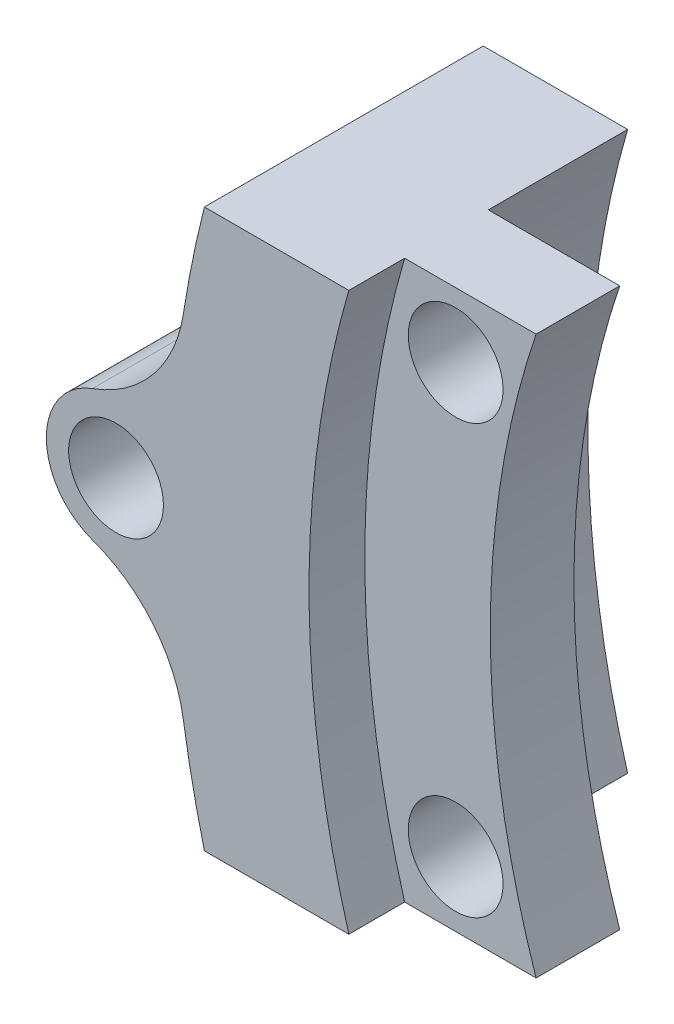
ISO-10303-21;
HEADER;
FILE_DESCRIPTION(('STEP AP214'),'2;1');
FILE_NAME('part.step','',(''),(''),'','','');
FILE_SCHEMA(('AUTOMOTIVE_DESIGN { 1 0 10303 214 1 1 1 1 }'));
ENDSEC;
DATA;
#1=APPLICATION_CONTEXT('core data for automotive mechanical design processes');
#2=APPLICATION_PROTOCOL_DEFINITION('international standard','automotive_design',2000,#1);
#3=PRODUCT_CONTEXT('',#1,'mechanical');
#4=PRODUCT('Part','Part','',(#3));
#5=PRODUCT_RELATED_PRODUCT_CATEGORY('part','',(#4));
#6=PRODUCT_DEFINITION_FORMATION('','',#4);
#7=PRODUCT_DEFINITION_CONTEXT('part definition',#1,'design');
#8=PRODUCT_DEFINITION('design','',#6,#7);
#9=PRODUCT_DEFINITION_SHAPE('','',#8);
#10=(LENGTH_UNIT() NAMED_UNIT(*) SI_UNIT(.MILLI.,.METRE.));
#11=(NAMED_UNIT(*) PLANE_ANGLE_UNIT() SI_UNIT($,.RADIAN.));
#12=(NAMED_UNIT(*) SI_UNIT($,.STERADIAN.) SOLID_ANGLE_UNIT());
#13=UNCERTAINTY_MEASURE_WITH_UNIT(LENGTH_MEASURE(1.E-05),#10,'distance_accuracy_value','');
#14=(GEOMETRIC_REPRESENTATION_CONTEXT(3) GLOBAL_UNCERTAINTY_ASSIGNED_CONTEXT((#13)) GLOBAL_UNIT_ASSIGNED_CONTEXT((#10,
#11,#12)) REPRESENTATION_CONTEXT('',''));
#15=CARTESIAN_POINT('',(0.,0.,0.));
#16=DIRECTION('',(0.,0.,1.));
#17=DIRECTION('',(1.,0.,0.));
#18=AXIS2_PLACEMENT_3D('',#15,#16,#17);
#19=CARTESIAN_POINT('',(0.,0.,0.));
#20=DIRECTION('',(0.,0.,1.));
#21=DIRECTION('',(1.,0.,0.));
#22=AXIS2_PLACEMENT_3D('',#19,#20,#21);
#23=PLANE('',#22);
#24=CARTESIAN_POINT('',(-42.6732405888687,0.,0.));
#25=DIRECTION('',(0.,0.,-1.));
#26=DIRECTION('',(-1.,0.,0.));
#27=AXIS2_PLACEMENT_3D('',#24,#25,#26);
#28=CIRCLE('',#27,2.64999999999999);
#29=CARTESIAN_POINT('',(-40.7110570278767,1.78110518301772,0.));
#30=VERTEX_POINT('',#29);
#31=CARTESIAN_POINT('',(-40.7110570278767,-1.78110518301772,0.));
#32=VERTEX_POINT('',#31);
#33=EDGE_CURVE('E135',#30,#32,#28,.T.);
#34=ORIENTED_EDGE('',*,*,#33,.F.);
#35=CARTESIAN_POINT('',(0.,0.,0.));
#36=DIRECTION('',(0.,0.,1.));
#37=DIRECTION('',(1.,0.,0.));
#38=AXIS2_PLACEMENT_3D('',#35,#36,#37);
#39=CIRCLE('',#38,40.75);
#40=CARTESIAN_POINT('',(-39.5039554981523,10.,0.));
#41=VERTEX_POINT('',#40);
#42=EDGE_CURVE('E146',#41,#30,#39,.T.);
#43=ORIENTED_EDGE('',*,*,#42,.F.);
#44=DIRECTION('',(-1.,0.,0.));
#45=VECTOR('',#44,1.);
#46=CARTESIAN_POINT('',(-39.5039554981523,10.,0.));
#47=LINE('',#46,#45);
#48=CARTESIAN_POINT('',(-34.3229150859888,10.,0.));
#49=VERTEX_POINT('',#48);
#50=EDGE_CURVE('E247',#49,#41,#47,.T.);
#51=ORIENTED_EDGE('',*,*,#50,.F.);
#52=CARTESIAN_POINT('',(0.,0.,0.));
#53=DIRECTION('',(0.,0.,1.));
#54=DIRECTION('',(1.,0.,0.));
#55=AXIS2_PLACEMENT_3D('',#52,#53,#54);
#56=CIRCLE('',#55,35.75);
#57=CARTESIAN_POINT('',(-34.3229150859888,-10.,0.));
#58=VERTEX_POINT('',#57);
#59=EDGE_CURVE('E203',#49,#58,#56,.T.);
#60=ORIENTED_EDGE('',*,*,#59,.T.);
#61=DIRECTION('',(1.,0.,0.));
#62=VECTOR('',#61,1.);
#63=CARTESIAN_POINT('',(-34.3229150859888,-10.,0.));
#64=LINE('',#63,#62);
#65=CARTESIAN_POINT('',(-39.5039554981523,-10.,0.));
#66=VERTEX_POINT('',#65);
#67=EDGE_CURVE('E255',#66,#58,#64,.T.);
#68=ORIENTED_EDGE('',*,*,#67,.F.);
#69=EDGE_CURVE('E208',#32,#66,#39,.T.);
#70=ORIENTED_EDGE('',*,*,#69,.F.);
#71=EDGE_LOOP('',(#34,#43,#51,#60,#68,#70));
#72=FACE_BOUND('',#71,.T.);
#73=ADVANCED_FACE('F32',(#72),#23,.F.);
#74=CARTESIAN_POINT('',(0.,0.,10.));
#75=DIRECTION('',(0.,0.,-1.));
#76=DIRECTION('',(-1.,0.,0.));
#77=AXIS2_PLACEMENT_3D('',#74,#75,#76);
#78=CYLINDRICAL_SURFACE('',#77,40.75);
#79=ORIENTED_EDGE('',*,*,#42,.T.);
#80=DIRECTION('',(0.,0.,-1.));
#81=VECTOR('',#80,1.);
#82=CARTESIAN_POINT('',(-40.7110570278767,1.78110518301773,2.5));
#83=LINE('',#82,#81);
#84=CARTESIAN_POINT('',(-40.7110570278767,1.78110518301774,5.));
#85=VERTEX_POINT('',#84);
#86=EDGE_CURVE('E131',#30,#85,#83,.F.);
#87=ORIENTED_EDGE('',*,*,#86,.T.);
#88=CARTESIAN_POINT('',(0.,0.,5.));
#89=DIRECTION('',(0.,0.,-1.));
#90=DIRECTION('',(1.,0.,0.));
#91=AXIS2_PLACEMENT_3D('',#88,#89,#90);
#92=CIRCLE('',#91,40.75);
#93=CARTESIAN_POINT('',(-40.2617479420352,6.28920922310784,5.));
#94=VERTEX_POINT('',#93);
#95=EDGE_CURVE('E142',#85,#94,#92,.T.);
#96=ORIENTED_EDGE('',*,*,#95,.T.);
#97=DIRECTION('',(0.,0.,-1.));
#98=VECTOR('',#97,1.);
#99=CARTESIAN_POINT('',(-40.2617479420352,6.28920922310784,10.));
#100=LINE('',#99,#98);
#101=CARTESIAN_POINT('',(-40.2617479420352,6.28920922310784,10.));
#102=VERTEX_POINT('',#101);
#103=EDGE_CURVE('E220',#94,#102,#100,.F.);
#104=ORIENTED_EDGE('',*,*,#103,.T.);
#105=CARTESIAN_POINT('',(0.,0.,10.));
#106=DIRECTION('',(0.,0.,1.));
#107=DIRECTION('',(1.,0.,0.));
#108=AXIS2_PLACEMENT_3D('',#105,#106,#107);
#109=CIRCLE('',#108,40.75);
#110=CARTESIAN_POINT('',(-39.5039554981523,10.,10.));
#111=VERTEX_POINT('',#110);
#112=EDGE_CURVE('E214',#111,#102,#109,.T.);
#113=ORIENTED_EDGE('',*,*,#112,.F.);
#114=DIRECTION('',(0.,0.,-1.));
#115=VECTOR('',#114,1.);
#116=CARTESIAN_POINT('',(-39.5039554981523,10.,10.));
#117=LINE('',#116,#115);
#118=EDGE_CURVE('E240',#111,#41,#117,.T.);
#119=ORIENTED_EDGE('',*,*,#118,.T.);
#120=EDGE_LOOP('',(#79,#87,#96,#104,#113,#119));
#121=FACE_BOUND('',#120,.T.);
#122=ADVANCED_FACE('F140',(#121),#78,.T.);
#123=CARTESIAN_POINT('',(0.,0.,10.));
#124=DIRECTION('',(0.,0.,-1.));
#125=DIRECTION('',(-1.,0.,0.));
#126=AXIS2_PLACEMENT_3D('',#123,#124,#125);
#127=CYLINDRICAL_SURFACE('',#126,35.75);
#128=DIRECTION('',(0.,0.,1.));
#129=VECTOR('',#128,1.);
#130=CARTESIAN_POINT('',(-34.3229150859888,-10.,-142.119605378212));
#131=LINE('',#130,#129);
#132=CARTESIAN_POINT('',(-34.3229150859888,-10.,5.));
#133=VERTEX_POINT('',#132);
#134=EDGE_CURVE('E256',#58,#133,#131,.T.);
#135=ORIENTED_EDGE('',*,*,#134,.F.);
#136=ORIENTED_EDGE('',*,*,#59,.F.);
#137=DIRECTION('',(0.,0.,-1.));
#138=VECTOR('',#137,1.);
#139=CARTESIAN_POINT('',(-34.3229150859888,10.,10.));
#140=LINE('',#139,#138);
#141=CARTESIAN_POINT('',(-34.3229150859888,10.,5.));
#142=VERTEX_POINT('',#141);
#143=EDGE_CURVE('E243',#142,#49,#140,.T.);
#144=ORIENTED_EDGE('',*,*,#143,.F.);
#145=CARTESIAN_POINT('',(0.,0.,5.));
#146=DIRECTION('',(0.,0.,-1.));
#147=DIRECTION('',(-1.,0.,0.));
#148=AXIS2_PLACEMENT_3D('',#145,#146,#147);
#149=CIRCLE('',#148,35.75);
#150=EDGE_CURVE('E174',#133,#142,#149,.T.);
#151=ORIENTED_EDGE('',*,*,#150,.F.);
#152=EDGE_LOOP('',(#135,#136,#144,#151));
#153=FACE_BOUND('',#152,.T.);
#154=ADVANCED_FACE('F285',(#153),#127,.F.);
#155=CARTESIAN_POINT('',(-34.3229150859888,-10.,8.00000000000001));
#156=VERTEX_POINT('',#155);
#157=CARTESIAN_POINT('',(-34.3229150859888,-10.,10.));
#158=VERTEX_POINT('',#157);
#159=EDGE_CURVE('E262',#156,#158,#131,.T.);
#160=ORIENTED_EDGE('',*,*,#159,.F.);
#161=CARTESIAN_POINT('',(0.,0.,8.));
#162=DIRECTION('',(0.,0.,-1.));
#163=DIRECTION('',(-1.,0.,0.));
#164=AXIS2_PLACEMENT_3D('',#161,#162,#163);
#165=CIRCLE('',#164,35.75);
#166=CARTESIAN_POINT('',(-34.3229150859888,10.,8.));
#167=VERTEX_POINT('',#166);
#168=EDGE_CURVE('E177',#156,#167,#165,.T.);
#169=ORIENTED_EDGE('',*,*,#168,.T.);
#170=CARTESIAN_POINT('',(-34.3229150859888,10.,10.));
#171=VERTEX_POINT('',#170);
#172=EDGE_CURVE('E242',#171,#167,#140,.T.);
#173=ORIENTED_EDGE('',*,*,#172,.F.);
#174=CARTESIAN_POINT('',(0.,0.,10.));
#175=DIRECTION('',(0.,0.,1.));
#176=DIRECTION('',(1.,0.,0.));
#177=AXIS2_PLACEMENT_3D('',#174,#175,#176);
#178=CIRCLE('',#177,35.75);
#179=EDGE_CURVE('E205',#171,#158,#178,.T.);
#180=ORIENTED_EDGE('',*,*,#179,.T.);
#181=EDGE_LOOP('',(#160,#169,#173,#180));
#182=FACE_BOUND('',#181,.T.);
#183=ADVANCED_FACE('F276',(#182),#127,.F.);
#184=CARTESIAN_POINT('',(0.,0.,10.));
#185=DIRECTION('',(0.,0.,1.));
#186=DIRECTION('',(1.,0.,0.));
#187=AXIS2_PLACEMENT_3D('',#184,#185,#186);
#188=PLANE('',#187);
#189=DIRECTION('',(-1.,0.,0.));
#190=VECTOR('',#189,1.);
#191=CARTESIAN_POINT('',(-34.3229150859888,-10.,10.));
#192=LINE('',#191,#190);
#193=CARTESIAN_POINT('',(-39.5039554981523,-10.,10.));
#194=VERTEX_POINT('',#193);
#195=EDGE_CURVE('E259',#158,#194,#192,.T.);
#196=ORIENTED_EDGE('',*,*,#195,.F.);
#197=ORIENTED_EDGE('',*,*,#179,.F.);
#198=DIRECTION('',(1.,0.,0.));
#199=VECTOR('',#198,1.);
#200=CARTESIAN_POINT('',(-39.5039554981523,10.,10.));
#201=LINE('',#200,#199);
#202=EDGE_CURVE('E147',#111,#171,#201,.T.);
#203=ORIENTED_EDGE('',*,*,#202,.F.);
#204=ORIENTED_EDGE('',*,*,#112,.T.);
#205=CARTESIAN_POINT('',(-45.201839714064,7.0608913363726,10.));
#206=DIRECTION('',(0.,0.,1.));
#207=DIRECTION('',(1.,0.,0.));
#208=AXIS2_PLACEMENT_3D('',#205,#206,#207);
#209=CIRCLE('',#208,5.);
#210=CARTESIAN_POINT('',(-43.5161069639338,2.35363044545753,10.));
#211=VERTEX_POINT('',#210);
#212=EDGE_CURVE('E40',#102,#211,#209,.F.);
#213=ORIENTED_EDGE('',*,*,#212,.T.);
#214=CARTESIAN_POINT('',(-42.6732405888687,0.,10.));
#215=DIRECTION('',(0.,0.,1.));
#216=DIRECTION('',(1.,0.,0.));
#217=AXIS2_PLACEMENT_3D('',#214,#215,#216);
#218=CIRCLE('',#217,2.5);
#219=CARTESIAN_POINT('',(-43.5161069639338,-2.35363044545753,10.));
#220=VERTEX_POINT('',#219);
#221=EDGE_CURVE('E152',#211,#220,#218,.T.);
#222=ORIENTED_EDGE('',*,*,#221,.T.);
#223=CARTESIAN_POINT('',(-45.201839714064,-7.06089133637259,10.));
#224=DIRECTION('',(0.,0.,1.));
#225=DIRECTION('',(1.,0.,0.));
#226=AXIS2_PLACEMENT_3D('',#223,#224,#225);
#227=CIRCLE('',#226,5.);
#228=CARTESIAN_POINT('',(-40.2617479420352,-6.28920922310783,10.));
#229=VERTEX_POINT('',#228);
#230=EDGE_CURVE('E224',#220,#229,#227,.F.);
#231=ORIENTED_EDGE('',*,*,#230,.T.);
#232=EDGE_CURVE('E211',#229,#194,#109,.T.);
#233=ORIENTED_EDGE('',*,*,#232,.T.);
#234=EDGE_LOOP('',(#196,#197,#203,#204,#213,#222,#231,#233));
#235=FACE_BOUND('',#234,.T.);
#236=CARTESIAN_POINT('',(-42.6732405888687,0.,10.));
#237=DIRECTION('',(0.,0.,1.));
#238=DIRECTION('',(1.,0.,0.));
#239=AXIS2_PLACEMENT_3D('',#236,#237,#238);
#240=CIRCLE('',#239,1.7);
#241=CARTESIAN_POINT('',(-40.9732405888687,0.,10.));
#242=VERTEX_POINT('',#241);
#243=EDGE_CURVE('E160',#242,#242,#240,.T.);
#244=ORIENTED_EDGE('',*,*,#243,.F.);
#245=EDGE_LOOP('',(#244));
#246=FACE_BOUND('',#245,.T.);
#247=ADVANCED_FACE('F231',(#235,#246),#188,.T.);
#248=CARTESIAN_POINT('',(-40.2617479420352,-6.28920922310783,5.));
#249=VERTEX_POINT('',#248);
#250=CARTESIAN_POINT('',(-40.7110570278767,-1.78110518301777,5.));
#251=VERTEX_POINT('',#250);
#252=EDGE_CURVE('E52',#249,#251,#92,.T.);
#253=ORIENTED_EDGE('',*,*,#252,.T.);
#254=DIRECTION('',(0.,0.,-1.));
#255=VECTOR('',#254,1.);
#256=CARTESIAN_POINT('',(-40.7110570278767,-1.78110518301773,2.5));
#257=LINE('',#256,#255);
#258=EDGE_CURVE('E134',#251,#32,#257,.T.);
#259=ORIENTED_EDGE('',*,*,#258,.T.);
#260=ORIENTED_EDGE('',*,*,#69,.T.);
#261=DIRECTION('',(0.,0.,-1.));
#262=VECTOR('',#261,1.);
#263=CARTESIAN_POINT('',(-39.5039554981523,-10.,10.));
#264=LINE('',#263,#262);
#265=EDGE_CURVE('E265',#66,#194,#264,.F.);
#266=ORIENTED_EDGE('',*,*,#265,.T.);
#267=ORIENTED_EDGE('',*,*,#232,.F.);
#268=DIRECTION('',(0.,0.,-1.));
#269=VECTOR('',#268,1.);
#270=CARTESIAN_POINT('',(-40.2617479420352,-6.28920922310783,10.));
#271=LINE('',#270,#269);
#272=EDGE_CURVE('E222',#229,#249,#271,.T.);
#273=ORIENTED_EDGE('',*,*,#272,.T.);
#274=EDGE_LOOP('',(#253,#259,#260,#266,#267,#273));
#275=FACE_BOUND('',#274,.T.);
#276=ADVANCED_FACE('F275',(#275),#78,.T.);
#277=CARTESIAN_POINT('',(-34.3229150859888,-10.,8.));
#278=DIRECTION('',(0.,-1.,0.));
#279=DIRECTION('',(1.,0.,0.));
#280=AXIS2_PLACEMENT_3D('',#277,#278,#279);
#281=PLANE('',#280);
#282=DIRECTION('',(-1.,0.,0.));
#283=VECTOR('',#282,1.);
#284=CARTESIAN_POINT('',(-34.3229150859888,-10.,5.));
#285=LINE('',#284,#283);
#286=CARTESIAN_POINT('',(-29.6067982058175,-10.,5.));
#287=VERTEX_POINT('',#286);
#288=EDGE_CURVE('E181',#287,#133,#285,.T.);
#289=ORIENTED_EDGE('',*,*,#288,.F.);
#290=DIRECTION('',(0.,0.,-1.));
#291=VECTOR('',#290,1.);
#292=CARTESIAN_POINT('',(-29.6067982058175,-10.,8.));
#293=LINE('',#292,#291);
#294=CARTESIAN_POINT('',(-29.6067982058175,-10.,8.));
#295=VERTEX_POINT('',#294);
#296=EDGE_CURVE('E201',#295,#287,#293,.T.);
#297=ORIENTED_EDGE('',*,*,#296,.F.);
#298=DIRECTION('',(-1.,0.,0.));
#299=VECTOR('',#298,1.);
#300=CARTESIAN_POINT('',(-34.3229150859888,-10.,8.));
#301=LINE('',#300,#299);
#302=EDGE_CURVE('E187',#295,#156,#301,.T.);
#303=ORIENTED_EDGE('',*,*,#302,.T.);
#304=ORIENTED_EDGE('',*,*,#159,.T.);
#305=ORIENTED_EDGE('',*,*,#195,.T.);
#306=ORIENTED_EDGE('',*,*,#265,.F.);
#307=ORIENTED_EDGE('',*,*,#67,.T.);
#308=ORIENTED_EDGE('',*,*,#134,.T.);
#309=EDGE_LOOP('',(#289,#297,#303,#304,#305,#306,#307,#308));
#310=FACE_BOUND('',#309,.T.);
#311=ADVANCED_FACE('F282',(#310),#281,.T.);
#312=CARTESIAN_POINT('',(0.,0.,8.));
#313=DIRECTION('',(0.,0.,-1.));
#314=DIRECTION('',(-1.,0.,0.));
#315=AXIS2_PLACEMENT_3D('',#312,#313,#314);
#316=CYLINDRICAL_SURFACE('',#315,31.25);
#317=CARTESIAN_POINT('',(0.,0.,5.));
#318=DIRECTION('',(0.,0.,1.));
#319=DIRECTION('',(-1.,0.,0.));
#320=AXIS2_PLACEMENT_3D('',#317,#318,#319);
#321=CIRCLE('',#320,31.25);
#322=CARTESIAN_POINT('',(-29.6067982058175,10.,5.));
#323=VERTEX_POINT('',#322);
#324=EDGE_CURVE('E196',#323,#287,#321,.T.);
#325=ORIENTED_EDGE('',*,*,#324,.F.);
#326=DIRECTION('',(0.,0.,-1.));
#327=VECTOR('',#326,1.);
#328=CARTESIAN_POINT('',(-29.6067982058175,10.,8.));
#329=LINE('',#328,#327);
#330=CARTESIAN_POINT('',(-29.6067982058175,10.,8.));
#331=VERTEX_POINT('',#330);
#332=EDGE_CURVE('E190',#331,#323,#329,.T.);
#333=ORIENTED_EDGE('',*,*,#332,.F.);
#334=CARTESIAN_POINT('',(0.,0.,8.));
#335=DIRECTION('',(0.,0.,1.));
#336=DIRECTION('',(-1.,0.,0.));
#337=AXIS2_PLACEMENT_3D('',#334,#335,#336);
#338=CIRCLE('',#337,31.25);
#339=EDGE_CURVE('E184',#331,#295,#338,.T.);
#340=ORIENTED_EDGE('',*,*,#339,.T.);
#341=ORIENTED_EDGE('',*,*,#296,.T.);
#342=EDGE_LOOP('',(#325,#333,#340,#341));
#343=FACE_BOUND('',#342,.T.);
#344=ADVANCED_FACE('F316',(#343),#316,.F.);
#345=CARTESIAN_POINT('',(-34.3229150859888,10.,8.));
#346=DIRECTION('',(0.,1.,0.));
#347=DIRECTION('',(-1.,0.,0.));
#348=AXIS2_PLACEMENT_3D('',#345,#346,#347);
#349=PLANE('',#348);
#350=DIRECTION('',(1.,0.,0.));
#351=VECTOR('',#350,1.);
#352=CARTESIAN_POINT('',(-34.3229150859888,10.,5.));
#353=LINE('',#352,#351);
#354=EDGE_CURVE('E193',#142,#323,#353,.T.);
#355=ORIENTED_EDGE('',*,*,#354,.F.);
#356=ORIENTED_EDGE('',*,*,#143,.T.);
#357=ORIENTED_EDGE('',*,*,#50,.T.);
#358=ORIENTED_EDGE('',*,*,#118,.F.);
#359=ORIENTED_EDGE('',*,*,#202,.T.);
#360=ORIENTED_EDGE('',*,*,#172,.T.);
#361=DIRECTION('',(1.,0.,0.));
#362=VECTOR('',#361,1.);
#363=CARTESIAN_POINT('',(-34.3229150859888,10.,8.));
#364=LINE('',#363,#362);
#365=EDGE_CURVE('E180',#167,#331,#364,.T.);
#366=ORIENTED_EDGE('',*,*,#365,.T.);
#367=ORIENTED_EDGE('',*,*,#332,.T.);
#368=EDGE_LOOP('',(#355,#356,#357,#358,#359,#360,#366,#367));
#369=FACE_BOUND('',#368,.T.);
#370=ADVANCED_FACE('F325',(#369),#349,.T.);
#371=CARTESIAN_POINT('',(0.,0.,8.));
#372=DIRECTION('',(0.,0.,-1.));
#373=DIRECTION('',(-1.,0.,0.));
#374=AXIS2_PLACEMENT_3D('',#371,#372,#373);
#375=PLANE('',#374);
#376=CARTESIAN_POINT('',(-32.4924184258218,-7.67716535443942,8.));
#377=DIRECTION('',(0.,0.,-1.));
#378=DIRECTION('',(1.,0.,0.));
#379=AXIS2_PLACEMENT_3D('',#376,#377,#378);
#380=CIRCLE('',#379,1.7);
#381=CARTESIAN_POINT('',(-30.7924184258218,-7.67716535443942,8.));
#382=VERTEX_POINT('',#381);
#383=EDGE_CURVE('E165',#382,#382,#380,.T.);
#384=ORIENTED_EDGE('',*,*,#383,.T.);
#385=EDGE_LOOP('',(#384));
#386=FACE_BOUND('',#385,.T.);
#387=CARTESIAN_POINT('',(-32.4924184258218,7.67716535443942,8.));
#388=DIRECTION('',(0.,0.,-1.));
#389=DIRECTION('',(-1.,0.,0.));
#390=AXIS2_PLACEMENT_3D('',#387,#388,#389);
#391=CIRCLE('',#390,1.7);
#392=CARTESIAN_POINT('',(-34.1924184258218,7.67716535443942,8.));
#393=VERTEX_POINT('',#392);
#394=EDGE_CURVE('E171',#393,#393,#391,.T.);
#395=ORIENTED_EDGE('',*,*,#394,.T.);
#396=EDGE_LOOP('',(#395));
#397=FACE_BOUND('',#396,.T.);
#398=ORIENTED_EDGE('',*,*,#168,.F.);
#399=ORIENTED_EDGE('',*,*,#302,.F.);
#400=ORIENTED_EDGE('',*,*,#339,.F.);
#401=ORIENTED_EDGE('',*,*,#365,.F.);
#402=EDGE_LOOP('',(#398,#399,#400,#401));
#403=FACE_BOUND('',#402,.T.);
#404=ADVANCED_FACE('F322',(#386,#397,#403),#375,.F.);
#405=CARTESIAN_POINT('',(0.,0.,5.));
#406=DIRECTION('',(0.,0.,-1.));
#407=DIRECTION('',(-1.,0.,0.));
#408=AXIS2_PLACEMENT_3D('',#405,#406,#407);
#409=PLANE('',#408);
#410=CARTESIAN_POINT('',(-32.4924184258218,-7.67716535443942,5.));
#411=DIRECTION('',(0.,0.,-1.));
#412=DIRECTION('',(1.,0.,0.));
#413=AXIS2_PLACEMENT_3D('',#410,#411,#412);
#414=CIRCLE('',#413,1.7);
#415=CARTESIAN_POINT('',(-30.7924184258218,-7.67716535443942,5.));
#416=VERTEX_POINT('',#415);
#417=EDGE_CURVE('E163',#416,#416,#414,.T.);
#418=ORIENTED_EDGE('',*,*,#417,.F.);
#419=EDGE_LOOP('',(#418));
#420=FACE_BOUND('',#419,.T.);
#421=CARTESIAN_POINT('',(-32.4924184258218,7.67716535443942,5.));
#422=DIRECTION('',(0.,0.,-1.));
#423=DIRECTION('',(-1.,0.,0.));
#424=AXIS2_PLACEMENT_3D('',#421,#422,#423);
#425=CIRCLE('',#424,1.7);
#426=CARTESIAN_POINT('',(-34.1924184258218,7.67716535443942,5.));
#427=VERTEX_POINT('',#426);
#428=EDGE_CURVE('E168',#427,#427,#425,.T.);
#429=ORIENTED_EDGE('',*,*,#428,.F.);
#430=EDGE_LOOP('',(#429));
#431=FACE_BOUND('',#430,.T.);
#432=ORIENTED_EDGE('',*,*,#150,.T.);
#433=ORIENTED_EDGE('',*,*,#354,.T.);
#434=ORIENTED_EDGE('',*,*,#324,.T.);
#435=ORIENTED_EDGE('',*,*,#288,.T.);
#436=EDGE_LOOP('',(#432,#433,#434,#435));
#437=FACE_BOUND('',#436,.T.);
#438=ADVANCED_FACE('F313',(#420,#431,#437),#409,.T.);
#439=CARTESIAN_POINT('',(-32.4924184258218,7.67716535443942,8.));
#440=DIRECTION('',(0.,0.,-1.));
#441=DIRECTION('',(-1.,0.,0.));
#442=AXIS2_PLACEMENT_3D('',#439,#440,#441);
#443=CYLINDRICAL_SURFACE('',#442,1.7);
#444=ORIENTED_EDGE('',*,*,#394,.F.);
#445=EDGE_LOOP('',(#444));
#446=FACE_BOUND('',#445,.T.);
#447=ORIENTED_EDGE('',*,*,#428,.T.);
#448=EDGE_LOOP('',(#447));
#449=FACE_BOUND('',#448,.T.);
#450=ADVANCED_FACE('F339',(#446,#449),#443,.F.);
#451=CARTESIAN_POINT('',(-32.4924184258218,-7.67716535443942,8.));
#452=DIRECTION('',(0.,0.,-1.));
#453=DIRECTION('',(-1.,0.,0.));
#454=AXIS2_PLACEMENT_3D('',#451,#452,#453);
#455=CYLINDRICAL_SURFACE('',#454,1.7);
#456=ORIENTED_EDGE('',*,*,#383,.F.);
#457=EDGE_LOOP('',(#456));
#458=FACE_BOUND('',#457,.T.);
#459=ORIENTED_EDGE('',*,*,#417,.T.);
#460=EDGE_LOOP('',(#459));
#461=FACE_BOUND('',#460,.T.);
#462=ADVANCED_FACE('F344',(#458,#461),#455,.F.);
#463=CARTESIAN_POINT('',(-42.6732405888687,0.,5.));
#464=DIRECTION('',(0.,0.,1.));
#465=DIRECTION('',(1.,0.,0.));
#466=AXIS2_PLACEMENT_3D('',#463,#464,#465);
#467=CYLINDRICAL_SURFACE('',#466,2.5);
#468=CARTESIAN_POINT('',(-42.6732405888687,0.,5.));
#469=DIRECTION('',(0.,0.,1.));
#470=DIRECTION('',(1.,0.,0.));
#471=AXIS2_PLACEMENT_3D('',#468,#469,#470);
#472=CIRCLE('',#471,2.5);
#473=CARTESIAN_POINT('',(-43.5161069639338,2.35363044545753,5.));
#474=VERTEX_POINT('',#473);
#475=CARTESIAN_POINT('',(-43.5161069639338,-2.35363044545753,5.));
#476=VERTEX_POINT('',#475);
#477=EDGE_CURVE('E154',#474,#476,#472,.T.);
#478=ORIENTED_EDGE('',*,*,#477,.T.);
#479=DIRECTION('',(0.,0.,1.));
#480=VECTOR('',#479,1.);
#481=CARTESIAN_POINT('',(-43.5161069639338,-2.35363044545753,5.));
#482=LINE('',#481,#480);
#483=EDGE_CURVE('E217',#476,#220,#482,.T.);
#484=ORIENTED_EDGE('',*,*,#483,.T.);
#485=ORIENTED_EDGE('',*,*,#221,.F.);
#486=DIRECTION('',(0.,0.,1.));
#487=VECTOR('',#486,1.);
#488=CARTESIAN_POINT('',(-43.5161069639338,2.35363044545753,5.));
#489=LINE('',#488,#487);
#490=EDGE_CURVE('E213',#211,#474,#489,.F.);
#491=ORIENTED_EDGE('',*,*,#490,.T.);
#492=EDGE_LOOP('',(#478,#484,#485,#491));
#493=FACE_BOUND('',#492,.T.);
#494=ADVANCED_FACE('F238',(#493),#467,.T.);
#495=CARTESIAN_POINT('',(0.,0.,5.));
#496=DIRECTION('',(0.,0.,1.));
#497=DIRECTION('',(1.,0.,0.));
#498=AXIS2_PLACEMENT_3D('',#495,#496,#497);
#499=PLANE('',#498);
#500=CARTESIAN_POINT('',(-42.6732405888687,0.,5.));
#501=DIRECTION('',(0.,0.,1.));
#502=DIRECTION('',(1.,0.,0.));
#503=AXIS2_PLACEMENT_3D('',#500,#501,#502);
#504=CIRCLE('',#503,1.7);
#505=CARTESIAN_POINT('',(-40.9732405888687,0.,5.));
#506=VERTEX_POINT('',#505);
#507=EDGE_CURVE('E156',#506,#506,#504,.T.);
#508=ORIENTED_EDGE('',*,*,#507,.T.);
#509=EDGE_LOOP('',(#508));
#510=FACE_BOUND('',#509,.T.);
#511=CARTESIAN_POINT('',(-45.201839714064,7.0608913363726,5.));
#512=DIRECTION('',(0.,0.,1.));
#513=DIRECTION('',(1.,0.,0.));
#514=AXIS2_PLACEMENT_3D('',#511,#512,#513);
#515=CIRCLE('',#514,5.);
#516=EDGE_CURVE('E11',#474,#94,#515,.T.);
#517=ORIENTED_EDGE('',*,*,#516,.T.);
#518=ORIENTED_EDGE('',*,*,#95,.F.);
#519=CARTESIAN_POINT('',(-42.6732405888687,0.,5.));
#520=DIRECTION('',(0.,0.,-1.));
#521=DIRECTION('',(-1.,0.,0.));
#522=AXIS2_PLACEMENT_3D('',#519,#520,#521);
#523=CIRCLE('',#522,2.65);
#524=EDGE_CURVE('E47',#85,#251,#523,.T.);
#525=ORIENTED_EDGE('',*,*,#524,.T.);
#526=ORIENTED_EDGE('',*,*,#252,.F.);
#527=CARTESIAN_POINT('',(-45.201839714064,-7.06089133637259,5.));
#528=DIRECTION('',(0.,0.,1.));
#529=DIRECTION('',(1.,0.,0.));
#530=AXIS2_PLACEMENT_3D('',#527,#528,#529);
#531=CIRCLE('',#530,5.);
#532=EDGE_CURVE('E226',#249,#476,#531,.T.);
#533=ORIENTED_EDGE('',*,*,#532,.T.);
#534=ORIENTED_EDGE('',*,*,#477,.F.);
#535=EDGE_LOOP('',(#517,#518,#525,#526,#533,#534));
#536=FACE_BOUND('',#535,.T.);
#537=ADVANCED_FACE('F149',(#510,#536),#499,.F.);
#538=CARTESIAN_POINT('',(-42.6732405888687,0.,5.));
#539=DIRECTION('',(0.,0.,1.));
#540=DIRECTION('',(1.,0.,0.));
#541=AXIS2_PLACEMENT_3D('',#538,#539,#540);
#542=CYLINDRICAL_SURFACE('',#541,1.7);
#543=ORIENTED_EDGE('',*,*,#507,.F.);
#544=EDGE_LOOP('',(#543));
#545=FACE_BOUND('',#544,.T.);
#546=ORIENTED_EDGE('',*,*,#243,.T.);
#547=EDGE_LOOP('',(#546));
#548=FACE_BOUND('',#547,.T.);
#549=ADVANCED_FACE('F273',(#545,#548),#542,.F.);
#550=CARTESIAN_POINT('',(-45.201839714064,-7.06089133637259,10.));
#551=DIRECTION('',(0.,0.,-1.));
#552=DIRECTION('',(-1.,0.,0.));
#553=AXIS2_PLACEMENT_3D('',#550,#551,#552);
#554=CYLINDRICAL_SURFACE('',#553,5.);
#555=ORIENTED_EDGE('',*,*,#532,.F.);
#556=ORIENTED_EDGE('',*,*,#272,.F.);
#557=ORIENTED_EDGE('',*,*,#230,.F.);
#558=ORIENTED_EDGE('',*,*,#483,.F.);
#559=EDGE_LOOP('',(#555,#556,#557,#558));
#560=FACE_BOUND('',#559,.T.);
#561=ADVANCED_FACE('F293',(#560),#554,.F.);
#562=CARTESIAN_POINT('',(-45.201839714064,7.0608913363726,5.));
#563=DIRECTION('',(0.,0.,-1.));
#564=DIRECTION('',(-1.,0.,0.));
#565=AXIS2_PLACEMENT_3D('',#562,#563,#564);
#566=CYLINDRICAL_SURFACE('',#565,5.);
#567=ORIENTED_EDGE('',*,*,#516,.F.);
#568=ORIENTED_EDGE('',*,*,#490,.F.);
#569=ORIENTED_EDGE('',*,*,#212,.F.);
#570=ORIENTED_EDGE('',*,*,#103,.F.);
#571=EDGE_LOOP('',(#567,#568,#569,#570));
#572=FACE_BOUND('',#571,.T.);
#573=ADVANCED_FACE('F34',(#572),#566,.F.);
#574=CARTESIAN_POINT('',(-42.6732405888687,0.,0.));
#575=DIRECTION('',(0.,0.,-1.));
#576=DIRECTION('',(-1.,0.,0.));
#577=AXIS2_PLACEMENT_3D('',#574,#575,#576);
#578=CYLINDRICAL_SURFACE('',#577,2.64999999999999);
#579=ORIENTED_EDGE('',*,*,#33,.T.);
#580=ORIENTED_EDGE('',*,*,#258,.F.);
#581=ORIENTED_EDGE('',*,*,#524,.F.);
#582=ORIENTED_EDGE('',*,*,#86,.F.);
#583=EDGE_LOOP('',(#579,#580,#581,#582));
#584=FACE_BOUND('',#583,.T.);
#585=ADVANCED_FACE('F130',(#584),#578,.F.);
#586=CLOSED_SHELL('',(#73,#122,#154,#183,#247,#276,#311,#344,#370,#404,#438,#450,#462,#494,#537,
#549,#561,#573,#585));
#587=MANIFOLD_SOLID_BREP('B2',#586);
#588=ADVANCED_BREP_SHAPE_REPRESENTATION('',(#18,#587),#14);
#589=SHAPE_DEFINITION_REPRESENTATION(#9,#588);
ENDSEC;
END-ISO-10303-21;
